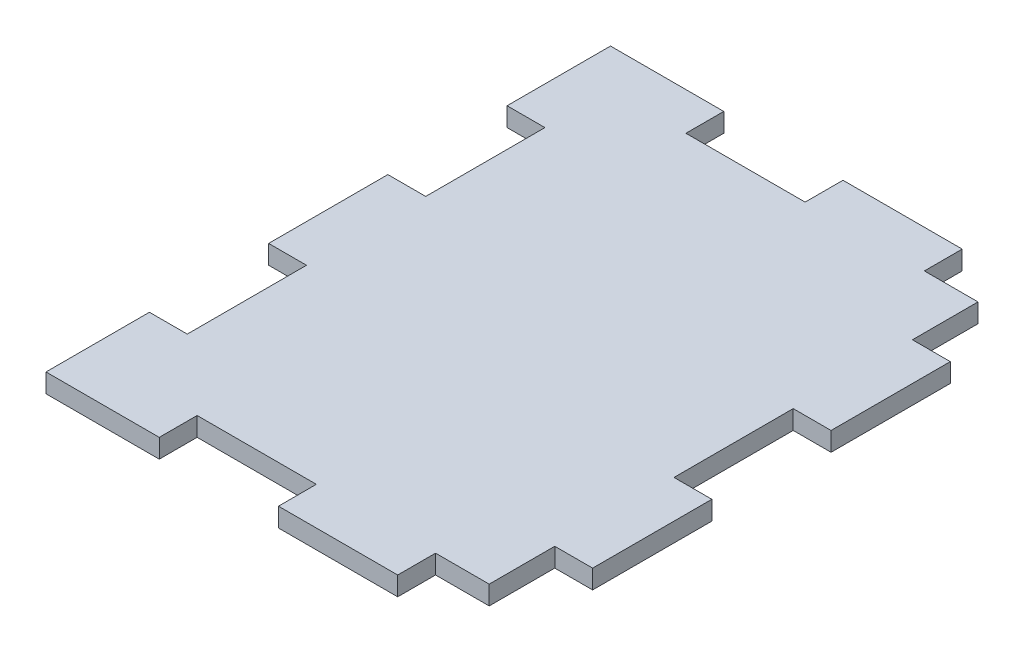
ISO-10303-21;
HEADER;
FILE_DESCRIPTION(('STEP AP214'),'2;1');
FILE_NAME('part.step','',(''),(''),'','','');
FILE_SCHEMA(('AUTOMOTIVE_DESIGN { 1 0 10303 214 1 1 1 1 }'));
ENDSEC;
DATA;
#1=APPLICATION_CONTEXT('core data for automotive mechanical design processes');
#2=APPLICATION_PROTOCOL_DEFINITION('international standard','automotive_design',2000,#1);
#3=PRODUCT_CONTEXT('',#1,'mechanical');
#4=PRODUCT('Part','Part','',(#3));
#5=PRODUCT_RELATED_PRODUCT_CATEGORY('part','',(#4));
#6=PRODUCT_DEFINITION_FORMATION('','',#4);
#7=PRODUCT_DEFINITION_CONTEXT('part definition',#1,'design');
#8=PRODUCT_DEFINITION('design','',#6,#7);
#9=PRODUCT_DEFINITION_SHAPE('','',#8);
#10=(LENGTH_UNIT() NAMED_UNIT(*) SI_UNIT(.MILLI.,.METRE.));
#11=(NAMED_UNIT(*) PLANE_ANGLE_UNIT() SI_UNIT($,.RADIAN.));
#12=(NAMED_UNIT(*) SI_UNIT($,.STERADIAN.) SOLID_ANGLE_UNIT());
#13=UNCERTAINTY_MEASURE_WITH_UNIT(LENGTH_MEASURE(1.E-05),#10,'distance_accuracy_value','');
#14=(GEOMETRIC_REPRESENTATION_CONTEXT(3) GLOBAL_UNCERTAINTY_ASSIGNED_CONTEXT((#13)) GLOBAL_UNIT_ASSIGNED_CONTEXT((#10,
#11,#12)) REPRESENTATION_CONTEXT('',''));
#15=CARTESIAN_POINT('',(0.,0.,0.));
#16=DIRECTION('',(0.,0.,1.));
#17=DIRECTION('',(1.,0.,0.));
#18=AXIS2_PLACEMENT_3D('',#15,#16,#17);
#19=CARTESIAN_POINT('',(0.,1.5875,-47.35));
#20=DIRECTION('',(0.,0.,1.));
#21=DIRECTION('',(1.,0.,0.));
#22=AXIS2_PLACEMENT_3D('',#19,#20,#21);
#23=PLANE('',#22);
#24=DIRECTION('',(0.,1.,0.));
#25=VECTOR('',#24,1.);
#26=CARTESIAN_POINT('',(9.49999999999975,0.,-47.35));
#27=LINE('',#26,#25);
#28=CARTESIAN_POINT('',(9.49999999999975,0.,-47.35));
#29=VERTEX_POINT('',#28);
#30=CARTESIAN_POINT('',(9.49999999999975,1.58750000000001,-47.35));
#31=VERTEX_POINT('',#30);
#32=EDGE_CURVE('E293',#29,#31,#27,.T.);
#33=ORIENTED_EDGE('',*,*,#32,.F.);
#34=DIRECTION('',(-1.,0.,0.));
#35=VECTOR('',#34,1.);
#36=CARTESIAN_POINT('',(0.,0.,-47.35));
#37=LINE('',#36,#35);
#38=CARTESIAN_POINT('',(0.,0.,-47.35));
#39=VERTEX_POINT('',#38);
#40=EDGE_CURVE('E469',#29,#39,#37,.T.);
#41=ORIENTED_EDGE('',*,*,#40,.T.);
#42=DIRECTION('',(0.,-1.,0.));
#43=VECTOR('',#42,1.);
#44=CARTESIAN_POINT('',(0.,1.5875,-47.35));
#45=LINE('',#44,#43);
#46=CARTESIAN_POINT('',(0.,1.5875,-47.35));
#47=VERTEX_POINT('',#46);
#48=EDGE_CURVE('E40',#47,#39,#45,.T.);
#49=ORIENTED_EDGE('',*,*,#48,.F.);
#50=DIRECTION('',(-1.,0.,0.));
#51=VECTOR('',#50,1.);
#52=CARTESIAN_POINT('',(0.,1.5875,-47.35));
#53=LINE('',#52,#51);
#54=EDGE_CURVE('E455',#31,#47,#53,.T.);
#55=ORIENTED_EDGE('',*,*,#54,.F.);
#56=EDGE_LOOP('',(#33,#41,#49,#55));
#57=FACE_BOUND('',#56,.T.);
#58=ADVANCED_FACE('F32',(#57),#23,.F.);
#59=CARTESIAN_POINT('',(0.,1.5875,0.));
#60=DIRECTION('',(0.,-1.,0.));
#61=DIRECTION('',(0.,0.,-1.));
#62=AXIS2_PLACEMENT_3D('',#59,#60,#61);
#63=PLANE('',#62);
#64=DIRECTION('',(0.,0.,-1.));
#65=VECTOR('',#64,1.);
#66=CARTESIAN_POINT('',(9.49999999999975,1.58750000000001,0.));
#67=LINE('',#66,#65);
#68=CARTESIAN_POINT('',(9.49999999999975,1.58750000000001,-44.175));
#69=VERTEX_POINT('',#68);
#70=EDGE_CURVE('E311',#69,#31,#67,.T.);
#71=ORIENTED_EDGE('',*,*,#70,.T.);
#72=ORIENTED_EDGE('',*,*,#54,.T.);
#73=DIRECTION('',(0.,0.,1.));
#74=VECTOR('',#73,1.);
#75=CARTESIAN_POINT('',(0.,1.5875,0.));
#76=LINE('',#75,#74);
#77=CARTESIAN_POINT('',(0.,1.5875,-38.675));
#78=VERTEX_POINT('',#77);
#79=EDGE_CURVE('E440',#47,#78,#76,.T.);
#80=ORIENTED_EDGE('',*,*,#79,.T.);
#81=DIRECTION('',(-1.,0.,0.));
#82=VECTOR('',#81,1.);
#83=CARTESIAN_POINT('',(0.,1.58750000000001,-38.675));
#84=LINE('',#83,#82);
#85=CARTESIAN_POINT('',(3.175,1.58750000000001,-38.675));
#86=VERTEX_POINT('',#85);
#87=EDGE_CURVE('E283',#86,#78,#84,.T.);
#88=ORIENTED_EDGE('',*,*,#87,.F.);
#89=DIRECTION('',(0.,0.,1.));
#90=VECTOR('',#89,1.);
#91=CARTESIAN_POINT('',(3.175,1.58750000000001,0.));
#92=LINE('',#91,#90);
#93=CARTESIAN_POINT('',(3.175,1.58750000000001,-28.675));
#94=VERTEX_POINT('',#93);
#95=EDGE_CURVE('E292',#86,#94,#92,.T.);
#96=ORIENTED_EDGE('',*,*,#95,.T.);
#97=DIRECTION('',(-1.,0.,0.));
#98=VECTOR('',#97,1.);
#99=CARTESIAN_POINT('',(0.,1.58750000000001,-28.675));
#100=LINE('',#99,#98);
#101=CARTESIAN_POINT('',(0.,1.58750000000001,-28.675));
#102=VERTEX_POINT('',#101);
#103=EDGE_CURVE('E289',#94,#102,#100,.T.);
#104=ORIENTED_EDGE('',*,*,#103,.T.);
#105=CARTESIAN_POINT('',(0.,1.5875,-18.675));
#106=VERTEX_POINT('',#105);
#107=EDGE_CURVE('E444',#102,#106,#76,.T.);
#108=ORIENTED_EDGE('',*,*,#107,.T.);
#109=DIRECTION('',(-1.,0.,0.));
#110=VECTOR('',#109,1.);
#111=CARTESIAN_POINT('',(0.,1.58750000000001,-18.675));
#112=LINE('',#111,#110);
#113=CARTESIAN_POINT('',(3.175,1.58750000000001,-18.675));
#114=VERTEX_POINT('',#113);
#115=EDGE_CURVE('E55',#114,#106,#112,.T.);
#116=ORIENTED_EDGE('',*,*,#115,.F.);
#117=DIRECTION('',(0.,0.,1.));
#118=VECTOR('',#117,1.);
#119=CARTESIAN_POINT('',(3.175,1.58750000000001,0.));
#120=LINE('',#119,#118);
#121=CARTESIAN_POINT('',(3.175,1.58750000000001,-8.67499999999887));
#122=VERTEX_POINT('',#121);
#123=EDGE_CURVE('E267',#114,#122,#120,.T.);
#124=ORIENTED_EDGE('',*,*,#123,.T.);
#125=DIRECTION('',(-1.,0.,0.));
#126=VECTOR('',#125,1.);
#127=CARTESIAN_POINT('',(0.,1.58750000000001,-8.67499999999887));
#128=LINE('',#127,#126);
#129=CARTESIAN_POINT('',(0.,1.58750000000001,-8.67499999999887));
#130=VERTEX_POINT('',#129);
#131=EDGE_CURVE('E258',#122,#130,#128,.T.);
#132=ORIENTED_EDGE('',*,*,#131,.T.);
#133=CARTESIAN_POINT('',(0.,1.5875,0.));
#134=VERTEX_POINT('',#133);
#135=EDGE_CURVE('E445',#130,#134,#76,.T.);
#136=ORIENTED_EDGE('',*,*,#135,.T.);
#137=DIRECTION('',(1.,0.,0.));
#138=VECTOR('',#137,1.);
#139=CARTESIAN_POINT('',(0.,1.5875,0.));
#140=LINE('',#139,#138);
#141=CARTESIAN_POINT('',(9.49999999999975,1.5875,0.));
#142=VERTEX_POINT('',#141);
#143=EDGE_CURVE('E446',#134,#142,#140,.T.);
#144=ORIENTED_EDGE('',*,*,#143,.T.);
#145=DIRECTION('',(0.,0.,1.));
#146=VECTOR('',#145,1.);
#147=CARTESIAN_POINT('',(9.49999999999975,1.58750000000001,0.));
#148=LINE('',#147,#146);
#149=CARTESIAN_POINT('',(9.49999999999975,1.58750000000001,-3.1749999999989));
#150=VERTEX_POINT('',#149);
#151=EDGE_CURVE('E396',#150,#142,#148,.T.);
#152=ORIENTED_EDGE('',*,*,#151,.F.);
#153=DIRECTION('',(-1.,0.,0.));
#154=VECTOR('',#153,1.);
#155=CARTESIAN_POINT('',(0.,1.58750000000001,-3.1749999999989));
#156=LINE('',#155,#154);
#157=CARTESIAN_POINT('',(19.4999999999998,1.58750000000001,-3.1749999999989));
#158=VERTEX_POINT('',#157);
#159=EDGE_CURVE('E276',#158,#150,#156,.T.);
#160=ORIENTED_EDGE('',*,*,#159,.F.);
#161=DIRECTION('',(0.,0.,1.));
#162=VECTOR('',#161,1.);
#163=CARTESIAN_POINT('',(19.4999999999998,1.58750000000001,0.));
#164=LINE('',#163,#162);
#165=CARTESIAN_POINT('',(19.4999999999998,1.58750000000001,0.));
#166=VERTEX_POINT('',#165);
#167=EDGE_CURVE('E388',#158,#166,#164,.T.);
#168=ORIENTED_EDGE('',*,*,#167,.T.);
#169=CARTESIAN_POINT('',(29.4999999999998,1.58750000000001,0.));
#170=VERTEX_POINT('',#169);
#171=EDGE_CURVE('E443',#166,#170,#140,.T.);
#172=ORIENTED_EDGE('',*,*,#171,.T.);
#173=DIRECTION('',(0.,0.,1.));
#174=VECTOR('',#173,1.);
#175=CARTESIAN_POINT('',(29.4999999999998,1.58750000000001,0.));
#176=LINE('',#175,#174);
#177=CARTESIAN_POINT('',(29.4999999999998,1.58750000000001,-3.1749999999989));
#178=VERTEX_POINT('',#177);
#179=EDGE_CURVE('E367',#178,#170,#176,.T.);
#180=ORIENTED_EDGE('',*,*,#179,.F.);
#181=DIRECTION('',(1.,0.,0.));
#182=VECTOR('',#181,1.);
#183=CARTESIAN_POINT('',(0.,1.58750000000001,-3.1749999999989));
#184=LINE('',#183,#182);
#185=CARTESIAN_POINT('',(34.,1.58750000000001,-3.1749999999989));
#186=VERTEX_POINT('',#185);
#187=EDGE_CURVE('E364',#178,#186,#184,.T.);
#188=ORIENTED_EDGE('',*,*,#187,.T.);
#189=DIRECTION('',(0.,0.,1.));
#190=VECTOR('',#189,1.);
#191=CARTESIAN_POINT('',(34.,1.58750000000001,0.));
#192=LINE('',#191,#190);
#193=CARTESIAN_POINT('',(34.,1.58750000000001,-8.67499999999887));
#194=VERTEX_POINT('',#193);
#195=EDGE_CURVE('E355',#194,#186,#192,.T.);
#196=ORIENTED_EDGE('',*,*,#195,.F.);
#197=DIRECTION('',(1.,0.,0.));
#198=VECTOR('',#197,1.);
#199=CARTESIAN_POINT('',(0.,1.58750000000001,-8.67499999999887));
#200=LINE('',#199,#198);
#201=CARTESIAN_POINT('',(37.175,1.58750000000001,-8.67499999999887));
#202=VERTEX_POINT('',#201);
#203=EDGE_CURVE('E370',#194,#202,#200,.T.);
#204=ORIENTED_EDGE('',*,*,#203,.T.);
#205=DIRECTION('',(0.,0.,-1.));
#206=VECTOR('',#205,1.);
#207=CARTESIAN_POINT('',(37.175,1.5875,0.));
#208=LINE('',#207,#206);
#209=CARTESIAN_POINT('',(37.175,1.5875,-18.675));
#210=VERTEX_POINT('',#209);
#211=EDGE_CURVE('E451',#202,#210,#208,.T.);
#212=ORIENTED_EDGE('',*,*,#211,.T.);
#213=DIRECTION('',(1.,0.,0.));
#214=VECTOR('',#213,1.);
#215=CARTESIAN_POINT('',(0.,1.58750000000001,-18.675));
#216=LINE('',#215,#214);
#217=CARTESIAN_POINT('',(34.,1.58750000000001,-18.675));
#218=VERTEX_POINT('',#217);
#219=EDGE_CURVE('E328',#218,#210,#216,.T.);
#220=ORIENTED_EDGE('',*,*,#219,.F.);
#221=DIRECTION('',(0.,0.,1.));
#222=VECTOR('',#221,1.);
#223=CARTESIAN_POINT('',(34.,1.58750000000001,0.));
#224=LINE('',#223,#222);
#225=CARTESIAN_POINT('',(34.,1.58750000000001,-28.675));
#226=VERTEX_POINT('',#225);
#227=EDGE_CURVE('E338',#226,#218,#224,.T.);
#228=ORIENTED_EDGE('',*,*,#227,.F.);
#229=DIRECTION('',(1.,0.,0.));
#230=VECTOR('',#229,1.);
#231=CARTESIAN_POINT('',(0.,1.58750000000001,-28.675));
#232=LINE('',#231,#230);
#233=CARTESIAN_POINT('',(37.175,1.58750000000001,-28.675));
#234=VERTEX_POINT('',#233);
#235=EDGE_CURVE('E335',#226,#234,#232,.T.);
#236=ORIENTED_EDGE('',*,*,#235,.T.);
#237=CARTESIAN_POINT('',(37.175,1.58750000000001,-38.675));
#238=VERTEX_POINT('',#237);
#239=EDGE_CURVE('E449',#234,#238,#208,.T.);
#240=ORIENTED_EDGE('',*,*,#239,.T.);
#241=DIRECTION('',(1.,0.,0.));
#242=VECTOR('',#241,1.);
#243=CARTESIAN_POINT('',(5.93275428784068E-13,1.58750000000001,-38.6750000000006));
#244=LINE('',#243,#242);
#245=CARTESIAN_POINT('',(34.,1.58750000000001,-38.675));
#246=VERTEX_POINT('',#245);
#247=EDGE_CURVE('E410',#246,#238,#244,.T.);
#248=ORIENTED_EDGE('',*,*,#247,.F.);
#249=DIRECTION('',(0.,0.,-1.));
#250=VECTOR('',#249,1.);
#251=CARTESIAN_POINT('',(34.,1.58750000000001,0.));
#252=LINE('',#251,#250);
#253=CARTESIAN_POINT('',(34.,1.58750000000001,-44.175));
#254=VERTEX_POINT('',#253);
#255=EDGE_CURVE('E425',#246,#254,#252,.T.);
#256=ORIENTED_EDGE('',*,*,#255,.T.);
#257=DIRECTION('',(1.,0.,0.));
#258=VECTOR('',#257,1.);
#259=CARTESIAN_POINT('',(0.,1.58750000000001,-44.175));
#260=LINE('',#259,#258);
#261=CARTESIAN_POINT('',(29.4999999999998,1.58750000000001,-44.175));
#262=VERTEX_POINT('',#261);
#263=EDGE_CURVE('E422',#262,#254,#260,.T.);
#264=ORIENTED_EDGE('',*,*,#263,.F.);
#265=DIRECTION('',(0.,0.,-1.));
#266=VECTOR('',#265,1.);
#267=CARTESIAN_POINT('',(29.4999999999998,1.58750000000001,0.));
#268=LINE('',#267,#266);
#269=CARTESIAN_POINT('',(29.4999999999998,1.58750000000001,-47.35));
#270=VERTEX_POINT('',#269);
#271=EDGE_CURVE('E345',#262,#270,#268,.T.);
#272=ORIENTED_EDGE('',*,*,#271,.T.);
#273=CARTESIAN_POINT('',(19.4999999999998,1.58750000000001,-47.35));
#274=VERTEX_POINT('',#273);
#275=EDGE_CURVE('E452',#270,#274,#53,.T.);
#276=ORIENTED_EDGE('',*,*,#275,.T.);
#277=DIRECTION('',(0.,0.,-1.));
#278=VECTOR('',#277,1.);
#279=CARTESIAN_POINT('',(19.4999999999998,1.58750000000001,0.));
#280=LINE('',#279,#278);
#281=CARTESIAN_POINT('',(19.4999999999998,1.58750000000001,-44.175));
#282=VERTEX_POINT('',#281);
#283=EDGE_CURVE('E307',#282,#274,#280,.T.);
#284=ORIENTED_EDGE('',*,*,#283,.F.);
#285=DIRECTION('',(-1.,0.,0.));
#286=VECTOR('',#285,1.);
#287=CARTESIAN_POINT('',(0.,1.58750000000001,-44.175));
#288=LINE('',#287,#286);
#289=EDGE_CURVE('E314',#282,#69,#288,.T.);
#290=ORIENTED_EDGE('',*,*,#289,.T.);
#291=EDGE_LOOP('',(#71,#72,#80,#88,#96,#104,#108,#116,#124,#132,#136,#144,#152,#160,#168,#172,
#180,#188,#196,#204,#212,#220,#228,#236,#240,#248,#256,#264,#272,#276,#284,#290));
#292=FACE_BOUND('',#291,.T.);
#293=ADVANCED_FACE('F486',(#292),#63,.F.);
#294=CARTESIAN_POINT('',(0.,0.,0.));
#295=DIRECTION('',(0.,-1.,0.));
#296=DIRECTION('',(0.,0.,-1.));
#297=AXIS2_PLACEMENT_3D('',#294,#295,#296);
#298=PLANE('',#297);
#299=ORIENTED_EDGE('',*,*,#40,.F.);
#300=DIRECTION('',(0.,0.,-1.));
#301=VECTOR('',#300,1.);
#302=CARTESIAN_POINT('',(9.49999999999975,0.,0.));
#303=LINE('',#302,#301);
#304=CARTESIAN_POINT('',(9.49999999999975,0.,-44.175));
#305=VERTEX_POINT('',#304);
#306=EDGE_CURVE('E304',#305,#29,#303,.T.);
#307=ORIENTED_EDGE('',*,*,#306,.F.);
#308=DIRECTION('',(-1.,0.,0.));
#309=VECTOR('',#308,1.);
#310=CARTESIAN_POINT('',(0.,0.,-44.175));
#311=LINE('',#310,#309);
#312=CARTESIAN_POINT('',(19.4999999999998,0.,-44.175));
#313=VERTEX_POINT('',#312);
#314=EDGE_CURVE('E306',#313,#305,#311,.T.);
#315=ORIENTED_EDGE('',*,*,#314,.F.);
#316=DIRECTION('',(0.,0.,-1.));
#317=VECTOR('',#316,1.);
#318=CARTESIAN_POINT('',(19.4999999999998,0.,0.));
#319=LINE('',#318,#317);
#320=CARTESIAN_POINT('',(19.4999999999998,0.,-47.35));
#321=VERTEX_POINT('',#320);
#322=EDGE_CURVE('E47',#313,#321,#319,.T.);
#323=ORIENTED_EDGE('',*,*,#322,.T.);
#324=CARTESIAN_POINT('',(29.4999999999998,0.,-47.35));
#325=VERTEX_POINT('',#324);
#326=EDGE_CURVE('E467',#325,#321,#37,.T.);
#327=ORIENTED_EDGE('',*,*,#326,.F.);
#328=DIRECTION('',(0.,0.,-1.));
#329=VECTOR('',#328,1.);
#330=CARTESIAN_POINT('',(29.4999999999998,0.,0.));
#331=LINE('',#330,#329);
#332=CARTESIAN_POINT('',(29.4999999999998,0.,-44.175));
#333=VERTEX_POINT('',#332);
#334=EDGE_CURVE('E407',#333,#325,#331,.T.);
#335=ORIENTED_EDGE('',*,*,#334,.F.);
#336=DIRECTION('',(1.,0.,0.));
#337=VECTOR('',#336,1.);
#338=CARTESIAN_POINT('',(0.,0.,-44.175));
#339=LINE('',#338,#337);
#340=CARTESIAN_POINT('',(34.,0.,-44.175));
#341=VERTEX_POINT('',#340);
#342=EDGE_CURVE('E409',#333,#341,#339,.T.);
#343=ORIENTED_EDGE('',*,*,#342,.T.);
#344=DIRECTION('',(0.,0.,-1.));
#345=VECTOR('',#344,1.);
#346=CARTESIAN_POINT('',(34.,0.,0.));
#347=LINE('',#346,#345);
#348=CARTESIAN_POINT('',(34.,0.,-38.675));
#349=VERTEX_POINT('',#348);
#350=EDGE_CURVE('E413',#349,#341,#347,.T.);
#351=ORIENTED_EDGE('',*,*,#350,.F.);
#352=DIRECTION('',(1.,0.,0.));
#353=VECTOR('',#352,1.);
#354=CARTESIAN_POINT('',(5.93275428784068E-13,0.,-38.6750000000006));
#355=LINE('',#354,#353);
#356=CARTESIAN_POINT('',(37.175,0.,-38.675));
#357=VERTEX_POINT('',#356);
#358=EDGE_CURVE('E416',#349,#357,#355,.T.);
#359=ORIENTED_EDGE('',*,*,#358,.T.);
#360=DIRECTION('',(0.,0.,-1.));
#361=VECTOR('',#360,1.);
#362=CARTESIAN_POINT('',(37.175,0.,0.));
#363=LINE('',#362,#361);
#364=CARTESIAN_POINT('',(37.175,0.,-28.675));
#365=VERTEX_POINT('',#364);
#366=EDGE_CURVE('E464',#365,#357,#363,.T.);
#367=ORIENTED_EDGE('',*,*,#366,.F.);
#368=DIRECTION('',(1.,0.,0.));
#369=VECTOR('',#368,1.);
#370=CARTESIAN_POINT('',(0.,0.,-28.675));
#371=LINE('',#370,#369);
#372=CARTESIAN_POINT('',(34.,0.,-28.675));
#373=VERTEX_POINT('',#372);
#374=EDGE_CURVE('E325',#373,#365,#371,.T.);
#375=ORIENTED_EDGE('',*,*,#374,.F.);
#376=DIRECTION('',(0.,0.,1.));
#377=VECTOR('',#376,1.);
#378=CARTESIAN_POINT('',(34.,0.,0.));
#379=LINE('',#378,#377);
#380=CARTESIAN_POINT('',(34.,0.,-18.675));
#381=VERTEX_POINT('',#380);
#382=EDGE_CURVE('E327',#373,#381,#379,.T.);
#383=ORIENTED_EDGE('',*,*,#382,.T.);
#384=DIRECTION('',(1.,0.,0.));
#385=VECTOR('',#384,1.);
#386=CARTESIAN_POINT('',(0.,0.,-18.675));
#387=LINE('',#386,#385);
#388=CARTESIAN_POINT('',(37.175,0.,-18.675));
#389=VERTEX_POINT('',#388);
#390=EDGE_CURVE('E331',#381,#389,#387,.T.);
#391=ORIENTED_EDGE('',*,*,#390,.T.);
#392=CARTESIAN_POINT('',(37.175,0.,-8.67499999999887));
#393=VERTEX_POINT('',#392);
#394=EDGE_CURVE('E466',#393,#389,#363,.T.);
#395=ORIENTED_EDGE('',*,*,#394,.F.);
#396=DIRECTION('',(1.,0.,0.));
#397=VECTOR('',#396,1.);
#398=CARTESIAN_POINT('',(0.,0.,-8.67499999999887));
#399=LINE('',#398,#397);
#400=CARTESIAN_POINT('',(34.,0.,-8.67499999999887));
#401=VERTEX_POINT('',#400);
#402=EDGE_CURVE('E358',#401,#393,#399,.T.);
#403=ORIENTED_EDGE('',*,*,#402,.F.);
#404=DIRECTION('',(0.,0.,1.));
#405=VECTOR('',#404,1.);
#406=CARTESIAN_POINT('',(34.,0.,0.));
#407=LINE('',#406,#405);
#408=CARTESIAN_POINT('',(34.,0.,-3.1749999999989));
#409=VERTEX_POINT('',#408);
#410=EDGE_CURVE('E360',#401,#409,#407,.T.);
#411=ORIENTED_EDGE('',*,*,#410,.T.);
#412=DIRECTION('',(1.,0.,0.));
#413=VECTOR('',#412,1.);
#414=CARTESIAN_POINT('',(0.,0.,-3.1749999999989));
#415=LINE('',#414,#413);
#416=CARTESIAN_POINT('',(29.4999999999998,0.,-3.1749999999989));
#417=VERTEX_POINT('',#416);
#418=EDGE_CURVE('E352',#417,#409,#415,.T.);
#419=ORIENTED_EDGE('',*,*,#418,.F.);
#420=DIRECTION('',(0.,0.,1.));
#421=VECTOR('',#420,1.);
#422=CARTESIAN_POINT('',(29.4999999999998,0.,0.));
#423=LINE('',#422,#421);
#424=CARTESIAN_POINT('',(29.4999999999998,0.,0.));
#425=VERTEX_POINT('',#424);
#426=EDGE_CURVE('E354',#417,#425,#423,.T.);
#427=ORIENTED_EDGE('',*,*,#426,.T.);
#428=DIRECTION('',(1.,0.,0.));
#429=VECTOR('',#428,1.);
#430=CARTESIAN_POINT('',(0.,0.,0.));
#431=LINE('',#430,#429);
#432=CARTESIAN_POINT('',(19.4999999999998,0.,0.));
#433=VERTEX_POINT('',#432);
#434=EDGE_CURVE('E459',#433,#425,#431,.T.);
#435=ORIENTED_EDGE('',*,*,#434,.F.);
#436=DIRECTION('',(0.,0.,1.));
#437=VECTOR('',#436,1.);
#438=CARTESIAN_POINT('',(19.4999999999998,0.,0.));
#439=LINE('',#438,#437);
#440=CARTESIAN_POINT('',(19.4999999999998,0.,-3.1749999999989));
#441=VERTEX_POINT('',#440);
#442=EDGE_CURVE('E391',#441,#433,#439,.T.);
#443=ORIENTED_EDGE('',*,*,#442,.F.);
#444=DIRECTION('',(-1.,0.,0.));
#445=VECTOR('',#444,1.);
#446=CARTESIAN_POINT('',(0.,0.,-3.1749999999989));
#447=LINE('',#446,#445);
#448=CARTESIAN_POINT('',(9.49999999999975,0.,-3.1749999999989));
#449=VERTEX_POINT('',#448);
#450=EDGE_CURVE('E384',#441,#449,#447,.T.);
#451=ORIENTED_EDGE('',*,*,#450,.T.);
#452=DIRECTION('',(0.,0.,1.));
#453=VECTOR('',#452,1.);
#454=CARTESIAN_POINT('',(9.49999999999975,0.,0.));
#455=LINE('',#454,#453);
#456=CARTESIAN_POINT('',(9.49999999999975,0.,0.));
#457=VERTEX_POINT('',#456);
#458=EDGE_CURVE('E387',#449,#457,#455,.T.);
#459=ORIENTED_EDGE('',*,*,#458,.T.);
#460=CARTESIAN_POINT('',(0.,0.,0.));
#461=VERTEX_POINT('',#460);
#462=EDGE_CURVE('E461',#461,#457,#431,.T.);
#463=ORIENTED_EDGE('',*,*,#462,.F.);
#464=DIRECTION('',(0.,0.,1.));
#465=VECTOR('',#464,1.);
#466=CARTESIAN_POINT('',(0.,0.,0.));
#467=LINE('',#466,#465);
#468=CARTESIAN_POINT('',(0.,0.,-8.67499999999887));
#469=VERTEX_POINT('',#468);
#470=EDGE_CURVE('E265',#469,#461,#467,.T.);
#471=ORIENTED_EDGE('',*,*,#470,.F.);
#472=DIRECTION('',(-1.,0.,0.));
#473=VECTOR('',#472,1.);
#474=CARTESIAN_POINT('',(0.,0.,-8.67499999999887));
#475=LINE('',#474,#473);
#476=CARTESIAN_POINT('',(3.175,0.,-8.67499999999887));
#477=VERTEX_POINT('',#476);
#478=EDGE_CURVE('E252',#477,#469,#475,.T.);
#479=ORIENTED_EDGE('',*,*,#478,.F.);
#480=DIRECTION('',(0.,0.,1.));
#481=VECTOR('',#480,1.);
#482=CARTESIAN_POINT('',(3.175,0.,0.));
#483=LINE('',#482,#481);
#484=CARTESIAN_POINT('',(3.175,0.,-18.675));
#485=VERTEX_POINT('',#484);
#486=EDGE_CURVE('E240',#485,#477,#483,.T.);
#487=ORIENTED_EDGE('',*,*,#486,.F.);
#488=DIRECTION('',(-1.,0.,0.));
#489=VECTOR('',#488,1.);
#490=CARTESIAN_POINT('',(0.,0.,-18.675));
#491=LINE('',#490,#489);
#492=CARTESIAN_POINT('',(0.,0.,-18.675));
#493=VERTEX_POINT('',#492);
#494=EDGE_CURVE('E251',#485,#493,#491,.T.);
#495=ORIENTED_EDGE('',*,*,#494,.T.);
#496=CARTESIAN_POINT('',(0.,0.,-28.675));
#497=VERTEX_POINT('',#496);
#498=EDGE_CURVE('E460',#497,#493,#467,.T.);
#499=ORIENTED_EDGE('',*,*,#498,.F.);
#500=DIRECTION('',(-1.,0.,0.));
#501=VECTOR('',#500,1.);
#502=CARTESIAN_POINT('',(0.,0.,-28.675));
#503=LINE('',#502,#501);
#504=CARTESIAN_POINT('',(3.175,0.,-28.675));
#505=VERTEX_POINT('',#504);
#506=EDGE_CURVE('E280',#505,#497,#503,.T.);
#507=ORIENTED_EDGE('',*,*,#506,.F.);
#508=DIRECTION('',(0.,0.,1.));
#509=VECTOR('',#508,1.);
#510=CARTESIAN_POINT('',(3.175,0.,0.));
#511=LINE('',#510,#509);
#512=CARTESIAN_POINT('',(3.175,0.,-38.675));
#513=VERTEX_POINT('',#512);
#514=EDGE_CURVE('E282',#513,#505,#511,.T.);
#515=ORIENTED_EDGE('',*,*,#514,.F.);
#516=DIRECTION('',(-1.,0.,0.));
#517=VECTOR('',#516,1.);
#518=CARTESIAN_POINT('',(0.,0.,-38.675));
#519=LINE('',#518,#517);
#520=CARTESIAN_POINT('',(0.,0.,-38.675));
#521=VERTEX_POINT('',#520);
#522=EDGE_CURVE('E285',#513,#521,#519,.T.);
#523=ORIENTED_EDGE('',*,*,#522,.T.);
#524=EDGE_CURVE('E456',#39,#521,#467,.T.);
#525=ORIENTED_EDGE('',*,*,#524,.F.);
#526=EDGE_LOOP('',(#299,#307,#315,#323,#327,#335,#343,#351,#359,#367,#375,#383,#391,#395,#403,
#411,#419,#427,#435,#443,#451,#459,#463,#471,#479,#487,#495,#499,#507,#515,#523,#525));
#527=FACE_BOUND('',#526,.T.);
#528=ADVANCED_FACE('F263',(#527),#298,.T.);
#529=CARTESIAN_POINT('',(0.,1.5875,0.));
#530=DIRECTION('',(1.,0.,0.));
#531=DIRECTION('',(0.,0.,-1.));
#532=AXIS2_PLACEMENT_3D('',#529,#530,#531);
#533=PLANE('',#532);
#534=DIRECTION('',(0.,1.,0.));
#535=VECTOR('',#534,1.);
#536=CARTESIAN_POINT('',(0.,0.,-28.675));
#537=LINE('',#536,#535);
#538=EDGE_CURVE('E272',#497,#102,#537,.T.);
#539=ORIENTED_EDGE('',*,*,#538,.F.);
#540=ORIENTED_EDGE('',*,*,#498,.T.);
#541=DIRECTION('',(0.,1.,0.));
#542=VECTOR('',#541,1.);
#543=CARTESIAN_POINT('',(0.,0.,-18.675));
#544=LINE('',#543,#542);
#545=EDGE_CURVE('E277',#493,#106,#544,.T.);
#546=ORIENTED_EDGE('',*,*,#545,.T.);
#547=ORIENTED_EDGE('',*,*,#107,.F.);
#548=EDGE_LOOP('',(#539,#540,#546,#547));
#549=FACE_BOUND('',#548,.T.);
#550=ADVANCED_FACE('F570',(#549),#533,.F.);
#551=DIRECTION('',(0.,1.,0.));
#552=VECTOR('',#551,1.);
#553=CARTESIAN_POINT('',(0.,0.,-8.67499999999887));
#554=LINE('',#553,#552);
#555=EDGE_CURVE('E274',#469,#130,#554,.T.);
#556=ORIENTED_EDGE('',*,*,#555,.F.);
#557=ORIENTED_EDGE('',*,*,#470,.T.);
#558=DIRECTION('',(0.,-1.,0.));
#559=VECTOR('',#558,1.);
#560=CARTESIAN_POINT('',(0.,1.5875,0.));
#561=LINE('',#560,#559);
#562=EDGE_CURVE('E11',#134,#461,#561,.T.);
#563=ORIENTED_EDGE('',*,*,#562,.F.);
#564=ORIENTED_EDGE('',*,*,#135,.F.);
#565=EDGE_LOOP('',(#556,#557,#563,#564));
#566=FACE_BOUND('',#565,.T.);
#567=ADVANCED_FACE('F571',(#566),#533,.F.);
#568=CARTESIAN_POINT('',(0.,1.5875,0.));
#569=DIRECTION('',(0.,0.,-1.));
#570=DIRECTION('',(-1.,0.,0.));
#571=AXIS2_PLACEMENT_3D('',#568,#569,#570);
#572=PLANE('',#571);
#573=DIRECTION('',(0.,1.,0.));
#574=VECTOR('',#573,1.);
#575=CARTESIAN_POINT('',(19.4999999999998,0.,0.));
#576=LINE('',#575,#574);
#577=EDGE_CURVE('E401',#433,#166,#576,.T.);
#578=ORIENTED_EDGE('',*,*,#577,.F.);
#579=ORIENTED_EDGE('',*,*,#434,.T.);
#580=DIRECTION('',(0.,1.,0.));
#581=VECTOR('',#580,1.);
#582=CARTESIAN_POINT('',(29.4999999999998,0.,0.));
#583=LINE('',#582,#581);
#584=EDGE_CURVE('E380',#425,#170,#583,.T.);
#585=ORIENTED_EDGE('',*,*,#584,.T.);
#586=ORIENTED_EDGE('',*,*,#171,.F.);
#587=EDGE_LOOP('',(#578,#579,#585,#586));
#588=FACE_BOUND('',#587,.T.);
#589=ADVANCED_FACE('F575',(#588),#572,.F.);
#590=CARTESIAN_POINT('',(37.175,1.5875,0.));
#591=DIRECTION('',(-1.,0.,0.));
#592=DIRECTION('',(0.,0.,1.));
#593=AXIS2_PLACEMENT_3D('',#590,#591,#592);
#594=PLANE('',#593);
#595=DIRECTION('',(0.,1.,0.));
#596=VECTOR('',#595,1.);
#597=CARTESIAN_POINT('',(37.175,0.,-8.67499999999887));
#598=LINE('',#597,#596);
#599=EDGE_CURVE('E378',#393,#202,#598,.T.);
#600=ORIENTED_EDGE('',*,*,#599,.F.);
#601=ORIENTED_EDGE('',*,*,#394,.T.);
#602=DIRECTION('',(0.,1.,0.));
#603=VECTOR('',#602,1.);
#604=CARTESIAN_POINT('',(37.175,0.,-18.675));
#605=LINE('',#604,#603);
#606=EDGE_CURVE('E346',#389,#210,#605,.T.);
#607=ORIENTED_EDGE('',*,*,#606,.T.);
#608=ORIENTED_EDGE('',*,*,#211,.F.);
#609=EDGE_LOOP('',(#600,#601,#607,#608));
#610=FACE_BOUND('',#609,.T.);
#611=ADVANCED_FACE('F497',(#610),#594,.F.);
#612=DIRECTION('',(0.,1.,0.));
#613=VECTOR('',#612,1.);
#614=CARTESIAN_POINT('',(37.175,0.,-28.675));
#615=LINE('',#614,#613);
#616=EDGE_CURVE('E343',#365,#234,#615,.T.);
#617=ORIENTED_EDGE('',*,*,#616,.F.);
#618=ORIENTED_EDGE('',*,*,#366,.T.);
#619=DIRECTION('',(0.,1.,0.));
#620=VECTOR('',#619,1.);
#621=CARTESIAN_POINT('',(37.175,0.,-38.675));
#622=LINE('',#621,#620);
#623=EDGE_CURVE('E432',#357,#238,#622,.T.);
#624=ORIENTED_EDGE('',*,*,#623,.T.);
#625=ORIENTED_EDGE('',*,*,#239,.F.);
#626=EDGE_LOOP('',(#617,#618,#624,#625));
#627=FACE_BOUND('',#626,.T.);
#628=ADVANCED_FACE('F515',(#627),#594,.F.);
#629=ORIENTED_EDGE('',*,*,#326,.T.);
#630=DIRECTION('',(0.,1.,0.));
#631=VECTOR('',#630,1.);
#632=CARTESIAN_POINT('',(19.4999999999998,0.,-47.35));
#633=LINE('',#632,#631);
#634=EDGE_CURVE('E319',#321,#274,#633,.T.);
#635=ORIENTED_EDGE('',*,*,#634,.T.);
#636=ORIENTED_EDGE('',*,*,#275,.F.);
#637=DIRECTION('',(0.,1.,0.));
#638=VECTOR('',#637,1.);
#639=CARTESIAN_POINT('',(29.4999999999998,0.,-47.35));
#640=LINE('',#639,#638);
#641=EDGE_CURVE('E430',#325,#270,#640,.T.);
#642=ORIENTED_EDGE('',*,*,#641,.F.);
#643=EDGE_LOOP('',(#629,#635,#636,#642));
#644=FACE_BOUND('',#643,.T.);
#645=ADVANCED_FACE('F536',(#644),#23,.F.);
#646=ORIENTED_EDGE('',*,*,#524,.T.);
#647=DIRECTION('',(0.,1.,0.));
#648=VECTOR('',#647,1.);
#649=CARTESIAN_POINT('',(0.,0.,-38.675));
#650=LINE('',#649,#648);
#651=EDGE_CURVE('E298',#521,#78,#650,.T.);
#652=ORIENTED_EDGE('',*,*,#651,.T.);
#653=ORIENTED_EDGE('',*,*,#79,.F.);
#654=ORIENTED_EDGE('',*,*,#48,.T.);
#655=EDGE_LOOP('',(#646,#652,#653,#654));
#656=FACE_BOUND('',#655,.T.);
#657=ADVANCED_FACE('F34',(#656),#533,.F.);
#658=ORIENTED_EDGE('',*,*,#462,.T.);
#659=DIRECTION('',(0.,1.,0.));
#660=VECTOR('',#659,1.);
#661=CARTESIAN_POINT('',(9.49999999999975,0.,0.));
#662=LINE('',#661,#660);
#663=EDGE_CURVE('E403',#457,#142,#662,.T.);
#664=ORIENTED_EDGE('',*,*,#663,.T.);
#665=ORIENTED_EDGE('',*,*,#143,.F.);
#666=ORIENTED_EDGE('',*,*,#562,.T.);
#667=EDGE_LOOP('',(#658,#664,#665,#666));
#668=FACE_BOUND('',#667,.T.);
#669=ADVANCED_FACE('F569',(#668),#572,.F.);
#670=CARTESIAN_POINT('',(29.4999999999998,0.,0.));
#671=DIRECTION('',(1.,0.,0.));
#672=DIRECTION('',(0.,0.,-1.));
#673=AXIS2_PLACEMENT_3D('',#670,#671,#672);
#674=PLANE('',#673);
#675=ORIENTED_EDGE('',*,*,#271,.F.);
#676=DIRECTION('',(0.,1.,0.));
#677=VECTOR('',#676,1.);
#678=CARTESIAN_POINT('',(29.4999999999998,0.,-44.175));
#679=LINE('',#678,#677);
#680=EDGE_CURVE('E419',#333,#262,#679,.T.);
#681=ORIENTED_EDGE('',*,*,#680,.F.);
#682=ORIENTED_EDGE('',*,*,#334,.T.);
#683=ORIENTED_EDGE('',*,*,#641,.T.);
#684=EDGE_LOOP('',(#675,#681,#682,#683));
#685=FACE_BOUND('',#684,.T.);
#686=ADVANCED_FACE('F532',(#685),#674,.T.);
#687=CARTESIAN_POINT('',(5.93275428784068E-13,0.,-38.6750000000006));
#688=DIRECTION('',(0.,0.,1.));
#689=DIRECTION('',(1.,0.,0.));
#690=AXIS2_PLACEMENT_3D('',#687,#688,#689);
#691=PLANE('',#690);
#692=ORIENTED_EDGE('',*,*,#247,.T.);
#693=ORIENTED_EDGE('',*,*,#623,.F.);
#694=ORIENTED_EDGE('',*,*,#358,.F.);
#695=DIRECTION('',(0.,1.,0.));
#696=VECTOR('',#695,1.);
#697=CARTESIAN_POINT('',(34.,0.,-38.675));
#698=LINE('',#697,#696);
#699=EDGE_CURVE('E435',#349,#246,#698,.T.);
#700=ORIENTED_EDGE('',*,*,#699,.T.);
#701=EDGE_LOOP('',(#692,#693,#694,#700));
#702=FACE_BOUND('',#701,.T.);
#703=ADVANCED_FACE('F519',(#702),#691,.F.);
#704=CARTESIAN_POINT('',(34.,0.,0.));
#705=DIRECTION('',(1.,0.,0.));
#706=DIRECTION('',(0.,0.,-1.));
#707=AXIS2_PLACEMENT_3D('',#704,#705,#706);
#708=PLANE('',#707);
#709=ORIENTED_EDGE('',*,*,#255,.F.);
#710=ORIENTED_EDGE('',*,*,#699,.F.);
#711=ORIENTED_EDGE('',*,*,#350,.T.);
#712=DIRECTION('',(0.,1.,0.));
#713=VECTOR('',#712,1.);
#714=CARTESIAN_POINT('',(34.,0.,-44.175));
#715=LINE('',#714,#713);
#716=EDGE_CURVE('E437',#341,#254,#715,.T.);
#717=ORIENTED_EDGE('',*,*,#716,.T.);
#718=EDGE_LOOP('',(#709,#710,#711,#717));
#719=FACE_BOUND('',#718,.T.);
#720=ADVANCED_FACE('F525',(#719),#708,.T.);
#721=CARTESIAN_POINT('',(0.,0.,-44.175));
#722=DIRECTION('',(0.,0.,1.));
#723=DIRECTION('',(1.,0.,0.));
#724=AXIS2_PLACEMENT_3D('',#721,#722,#723);
#725=PLANE('',#724);
#726=ORIENTED_EDGE('',*,*,#263,.T.);
#727=ORIENTED_EDGE('',*,*,#716,.F.);
#728=ORIENTED_EDGE('',*,*,#342,.F.);
#729=ORIENTED_EDGE('',*,*,#680,.T.);
#730=EDGE_LOOP('',(#726,#727,#728,#729));
#731=FACE_BOUND('',#730,.T.);
#732=ADVANCED_FACE('F530',(#731),#725,.F.);
#733=CARTESIAN_POINT('',(0.,0.,-28.675));
#734=DIRECTION('',(0.,0.,1.));
#735=DIRECTION('',(1.,0.,0.));
#736=AXIS2_PLACEMENT_3D('',#733,#734,#735);
#737=PLANE('',#736);
#738=ORIENTED_EDGE('',*,*,#235,.F.);
#739=DIRECTION('',(0.,1.,0.));
#740=VECTOR('',#739,1.);
#741=CARTESIAN_POINT('',(34.,0.,-28.675));
#742=LINE('',#741,#740);
#743=EDGE_CURVE('E334',#373,#226,#742,.T.);
#744=ORIENTED_EDGE('',*,*,#743,.F.);
#745=ORIENTED_EDGE('',*,*,#374,.T.);
#746=ORIENTED_EDGE('',*,*,#616,.T.);
#747=EDGE_LOOP('',(#738,#744,#745,#746));
#748=FACE_BOUND('',#747,.T.);
#749=ADVANCED_FACE('F639',(#748),#737,.T.);
#750=CARTESIAN_POINT('',(0.,0.,-18.675));
#751=DIRECTION('',(0.,0.,1.));
#752=DIRECTION('',(1.,0.,0.));
#753=AXIS2_PLACEMENT_3D('',#750,#751,#752);
#754=PLANE('',#753);
#755=ORIENTED_EDGE('',*,*,#219,.T.);
#756=ORIENTED_EDGE('',*,*,#606,.F.);
#757=ORIENTED_EDGE('',*,*,#390,.F.);
#758=DIRECTION('',(0.,1.,0.));
#759=VECTOR('',#758,1.);
#760=CARTESIAN_POINT('',(34.,0.,-18.675));
#761=LINE('',#760,#759);
#762=EDGE_CURVE('E349',#381,#218,#761,.T.);
#763=ORIENTED_EDGE('',*,*,#762,.T.);
#764=EDGE_LOOP('',(#755,#756,#757,#763));
#765=FACE_BOUND('',#764,.T.);
#766=ADVANCED_FACE('F502',(#765),#754,.F.);
#767=CARTESIAN_POINT('',(34.,0.,0.));
#768=DIRECTION('',(-1.,0.,0.));
#769=DIRECTION('',(0.,0.,1.));
#770=AXIS2_PLACEMENT_3D('',#767,#768,#769);
#771=PLANE('',#770);
#772=ORIENTED_EDGE('',*,*,#227,.T.);
#773=ORIENTED_EDGE('',*,*,#762,.F.);
#774=ORIENTED_EDGE('',*,*,#382,.F.);
#775=ORIENTED_EDGE('',*,*,#743,.T.);
#776=EDGE_LOOP('',(#772,#773,#774,#775));
#777=FACE_BOUND('',#776,.T.);
#778=ADVANCED_FACE('F508',(#777),#771,.F.);
#779=CARTESIAN_POINT('',(0.,0.,-3.1749999999989));
#780=DIRECTION('',(0.,0.,1.));
#781=DIRECTION('',(1.,0.,0.));
#782=AXIS2_PLACEMENT_3D('',#779,#780,#781);
#783=PLANE('',#782);
#784=ORIENTED_EDGE('',*,*,#187,.F.);
#785=DIRECTION('',(0.,1.,0.));
#786=VECTOR('',#785,1.);
#787=CARTESIAN_POINT('',(29.4999999999998,0.,-3.1749999999989));
#788=LINE('',#787,#786);
#789=EDGE_CURVE('E363',#417,#178,#788,.T.);
#790=ORIENTED_EDGE('',*,*,#789,.F.);
#791=ORIENTED_EDGE('',*,*,#418,.T.);
#792=DIRECTION('',(0.,1.,0.));
#793=VECTOR('',#792,1.);
#794=CARTESIAN_POINT('',(34.,0.,-3.1749999999989));
#795=LINE('',#794,#793);
#796=EDGE_CURVE('E339',#409,#186,#795,.T.);
#797=ORIENTED_EDGE('',*,*,#796,.T.);
#798=EDGE_LOOP('',(#784,#790,#791,#797));
#799=FACE_BOUND('',#798,.T.);
#800=ADVANCED_FACE('F728',(#799),#783,.T.);
#801=CARTESIAN_POINT('',(34.,0.,0.));
#802=DIRECTION('',(-1.,0.,0.));
#803=DIRECTION('',(0.,0.,1.));
#804=AXIS2_PLACEMENT_3D('',#801,#802,#803);
#805=PLANE('',#804);
#806=ORIENTED_EDGE('',*,*,#195,.T.);
#807=ORIENTED_EDGE('',*,*,#796,.F.);
#808=ORIENTED_EDGE('',*,*,#410,.F.);
#809=DIRECTION('',(0.,1.,0.));
#810=VECTOR('',#809,1.);
#811=CARTESIAN_POINT('',(34.,0.,-8.67499999999887));
#812=LINE('',#811,#810);
#813=EDGE_CURVE('E376',#401,#194,#812,.T.);
#814=ORIENTED_EDGE('',*,*,#813,.T.);
#815=EDGE_LOOP('',(#806,#807,#808,#814));
#816=FACE_BOUND('',#815,.T.);
#817=ADVANCED_FACE('F737',(#816),#805,.F.);
#818=CARTESIAN_POINT('',(0.,0.,-8.67499999999887));
#819=DIRECTION('',(0.,0.,1.));
#820=DIRECTION('',(1.,0.,0.));
#821=AXIS2_PLACEMENT_3D('',#818,#819,#820);
#822=PLANE('',#821);
#823=ORIENTED_EDGE('',*,*,#203,.F.);
#824=ORIENTED_EDGE('',*,*,#813,.F.);
#825=ORIENTED_EDGE('',*,*,#402,.T.);
#826=ORIENTED_EDGE('',*,*,#599,.T.);
#827=EDGE_LOOP('',(#823,#824,#825,#826));
#828=FACE_BOUND('',#827,.T.);
#829=ADVANCED_FACE('F746',(#828),#822,.T.);
#830=CARTESIAN_POINT('',(29.4999999999998,0.,0.));
#831=DIRECTION('',(-1.,0.,0.));
#832=DIRECTION('',(0.,0.,1.));
#833=AXIS2_PLACEMENT_3D('',#830,#831,#832);
#834=PLANE('',#833);
#835=ORIENTED_EDGE('',*,*,#179,.T.);
#836=ORIENTED_EDGE('',*,*,#584,.F.);
#837=ORIENTED_EDGE('',*,*,#426,.F.);
#838=ORIENTED_EDGE('',*,*,#789,.T.);
#839=EDGE_LOOP('',(#835,#836,#837,#838));
#840=FACE_BOUND('',#839,.T.);
#841=ADVANCED_FACE('F599',(#840),#834,.F.);
#842=CARTESIAN_POINT('',(0.,0.,-3.1749999999989));
#843=DIRECTION('',(0.,0.,-1.));
#844=DIRECTION('',(-1.,0.,0.));
#845=AXIS2_PLACEMENT_3D('',#842,#843,#844);
#846=PLANE('',#845);
#847=ORIENTED_EDGE('',*,*,#159,.T.);
#848=DIRECTION('',(0.,1.,0.));
#849=VECTOR('',#848,1.);
#850=CARTESIAN_POINT('',(9.49999999999975,0.,-3.1749999999989));
#851=LINE('',#850,#849);
#852=EDGE_CURVE('E393',#449,#150,#851,.T.);
#853=ORIENTED_EDGE('',*,*,#852,.F.);
#854=ORIENTED_EDGE('',*,*,#450,.F.);
#855=DIRECTION('',(0.,1.,0.));
#856=VECTOR('',#855,1.);
#857=CARTESIAN_POINT('',(19.4999999999998,0.,-3.1749999999989));
#858=LINE('',#857,#856);
#859=EDGE_CURVE('E368',#441,#158,#858,.T.);
#860=ORIENTED_EDGE('',*,*,#859,.T.);
#861=EDGE_LOOP('',(#847,#853,#854,#860));
#862=FACE_BOUND('',#861,.T.);
#863=ADVANCED_FACE('F607',(#862),#846,.F.);
#864=CARTESIAN_POINT('',(19.4999999999998,0.,0.));
#865=DIRECTION('',(-1.,0.,0.));
#866=DIRECTION('',(0.,0.,1.));
#867=AXIS2_PLACEMENT_3D('',#864,#865,#866);
#868=PLANE('',#867);
#869=ORIENTED_EDGE('',*,*,#167,.F.);
#870=ORIENTED_EDGE('',*,*,#859,.F.);
#871=ORIENTED_EDGE('',*,*,#442,.T.);
#872=ORIENTED_EDGE('',*,*,#577,.T.);
#873=EDGE_LOOP('',(#869,#870,#871,#872));
#874=FACE_BOUND('',#873,.T.);
#875=ADVANCED_FACE('F604',(#874),#868,.T.);
#876=CARTESIAN_POINT('',(9.49999999999975,0.,0.));
#877=DIRECTION('',(-1.,0.,0.));
#878=DIRECTION('',(0.,0.,1.));
#879=AXIS2_PLACEMENT_3D('',#876,#877,#878);
#880=PLANE('',#879);
#881=ORIENTED_EDGE('',*,*,#151,.T.);
#882=ORIENTED_EDGE('',*,*,#663,.F.);
#883=ORIENTED_EDGE('',*,*,#458,.F.);
#884=ORIENTED_EDGE('',*,*,#852,.T.);
#885=EDGE_LOOP('',(#881,#882,#883,#884));
#886=FACE_BOUND('',#885,.T.);
#887=ADVANCED_FACE('F621',(#886),#880,.F.);
#888=CARTESIAN_POINT('',(0.,0.,-8.67499999999887));
#889=DIRECTION('',(0.,0.,-1.));
#890=DIRECTION('',(-1.,0.,0.));
#891=AXIS2_PLACEMENT_3D('',#888,#889,#890);
#892=PLANE('',#891);
#893=ORIENTED_EDGE('',*,*,#131,.F.);
#894=DIRECTION('',(0.,1.,0.));
#895=VECTOR('',#894,1.);
#896=CARTESIAN_POINT('',(3.175,0.,-8.67499999999887));
#897=LINE('',#896,#895);
#898=EDGE_CURVE('E244',#477,#122,#897,.T.);
#899=ORIENTED_EDGE('',*,*,#898,.F.);
#900=ORIENTED_EDGE('',*,*,#478,.T.);
#901=ORIENTED_EDGE('',*,*,#555,.T.);
#902=EDGE_LOOP('',(#893,#899,#900,#901));
#903=FACE_BOUND('',#902,.T.);
#904=ADVANCED_FACE('F255',(#903),#892,.T.);
#905=CARTESIAN_POINT('',(0.,0.,-18.675));
#906=DIRECTION('',(0.,0.,-1.));
#907=DIRECTION('',(-1.,0.,0.));
#908=AXIS2_PLACEMENT_3D('',#905,#906,#907);
#909=PLANE('',#908);
#910=ORIENTED_EDGE('',*,*,#115,.T.);
#911=ORIENTED_EDGE('',*,*,#545,.F.);
#912=ORIENTED_EDGE('',*,*,#494,.F.);
#913=DIRECTION('',(0.,1.,0.));
#914=VECTOR('',#913,1.);
#915=CARTESIAN_POINT('',(3.175,0.,-18.675));
#916=LINE('',#915,#914);
#917=EDGE_CURVE('E246',#485,#114,#916,.T.);
#918=ORIENTED_EDGE('',*,*,#917,.T.);
#919=EDGE_LOOP('',(#910,#911,#912,#918));
#920=FACE_BOUND('',#919,.T.);
#921=ADVANCED_FACE('F619',(#920),#909,.F.);
#922=CARTESIAN_POINT('',(3.175,0.,0.));
#923=DIRECTION('',(-1.,0.,0.));
#924=DIRECTION('',(0.,0.,1.));
#925=AXIS2_PLACEMENT_3D('',#922,#923,#924);
#926=PLANE('',#925);
#927=ORIENTED_EDGE('',*,*,#123,.F.);
#928=ORIENTED_EDGE('',*,*,#917,.F.);
#929=ORIENTED_EDGE('',*,*,#486,.T.);
#930=ORIENTED_EDGE('',*,*,#898,.T.);
#931=EDGE_LOOP('',(#927,#928,#929,#930));
#932=FACE_BOUND('',#931,.T.);
#933=ADVANCED_FACE('F243',(#932),#926,.T.);
#934=CARTESIAN_POINT('',(0.,0.,-28.675));
#935=DIRECTION('',(0.,0.,-1.));
#936=DIRECTION('',(-1.,0.,0.));
#937=AXIS2_PLACEMENT_3D('',#934,#935,#936);
#938=PLANE('',#937);
#939=ORIENTED_EDGE('',*,*,#103,.F.);
#940=DIRECTION('',(0.,1.,0.));
#941=VECTOR('',#940,1.);
#942=CARTESIAN_POINT('',(3.175,0.,-28.675));
#943=LINE('',#942,#941);
#944=EDGE_CURVE('E288',#505,#94,#943,.T.);
#945=ORIENTED_EDGE('',*,*,#944,.F.);
#946=ORIENTED_EDGE('',*,*,#506,.T.);
#947=ORIENTED_EDGE('',*,*,#538,.T.);
#948=EDGE_LOOP('',(#939,#945,#946,#947));
#949=FACE_BOUND('',#948,.T.);
#950=ADVANCED_FACE('F803',(#949),#938,.T.);
#951=CARTESIAN_POINT('',(0.,0.,-38.675));
#952=DIRECTION('',(0.,0.,-1.));
#953=DIRECTION('',(-1.,0.,0.));
#954=AXIS2_PLACEMENT_3D('',#951,#952,#953);
#955=PLANE('',#954);
#956=ORIENTED_EDGE('',*,*,#87,.T.);
#957=ORIENTED_EDGE('',*,*,#651,.F.);
#958=ORIENTED_EDGE('',*,*,#522,.F.);
#959=DIRECTION('',(0.,1.,0.));
#960=VECTOR('',#959,1.);
#961=CARTESIAN_POINT('',(3.175,0.,-38.675));
#962=LINE('',#961,#960);
#963=EDGE_CURVE('E301',#513,#86,#962,.T.);
#964=ORIENTED_EDGE('',*,*,#963,.T.);
#965=EDGE_LOOP('',(#956,#957,#958,#964));
#966=FACE_BOUND('',#965,.T.);
#967=ADVANCED_FACE('F482',(#966),#955,.F.);
#968=CARTESIAN_POINT('',(3.175,0.,0.));
#969=DIRECTION('',(-1.,0.,0.));
#970=DIRECTION('',(0.,0.,1.));
#971=AXIS2_PLACEMENT_3D('',#968,#969,#970);
#972=PLANE('',#971);
#973=ORIENTED_EDGE('',*,*,#95,.F.);
#974=ORIENTED_EDGE('',*,*,#963,.F.);
#975=ORIENTED_EDGE('',*,*,#514,.T.);
#976=ORIENTED_EDGE('',*,*,#944,.T.);
#977=EDGE_LOOP('',(#973,#974,#975,#976));
#978=FACE_BOUND('',#977,.T.);
#979=ADVANCED_FACE('F553',(#978),#972,.T.);
#980=CARTESIAN_POINT('',(9.49999999999975,0.,0.));
#981=DIRECTION('',(1.,0.,0.));
#982=DIRECTION('',(0.,0.,-1.));
#983=AXIS2_PLACEMENT_3D('',#980,#981,#982);
#984=PLANE('',#983);
#985=ORIENTED_EDGE('',*,*,#70,.F.);
#986=DIRECTION('',(0.,1.,0.));
#987=VECTOR('',#986,1.);
#988=CARTESIAN_POINT('',(9.49999999999975,0.,-44.175));
#989=LINE('',#988,#987);
#990=EDGE_CURVE('E310',#305,#69,#989,.T.);
#991=ORIENTED_EDGE('',*,*,#990,.F.);
#992=ORIENTED_EDGE('',*,*,#306,.T.);
#993=ORIENTED_EDGE('',*,*,#32,.T.);
#994=EDGE_LOOP('',(#985,#991,#992,#993));
#995=FACE_BOUND('',#994,.T.);
#996=ADVANCED_FACE('F543',(#995),#984,.T.);
#997=CARTESIAN_POINT('',(19.4999999999998,0.,0.));
#998=DIRECTION('',(1.,0.,0.));
#999=DIRECTION('',(0.,0.,-1.));
#1000=AXIS2_PLACEMENT_3D('',#997,#998,#999);
#1001=PLANE('',#1000);
#1002=ORIENTED_EDGE('',*,*,#283,.T.);
#1003=ORIENTED_EDGE('',*,*,#634,.F.);
#1004=ORIENTED_EDGE('',*,*,#322,.F.);
#1005=DIRECTION('',(0.,1.,0.));
#1006=VECTOR('',#1005,1.);
#1007=CARTESIAN_POINT('',(19.4999999999998,0.,-44.175));
#1008=LINE('',#1007,#1006);
#1009=EDGE_CURVE('E322',#313,#282,#1008,.T.);
#1010=ORIENTED_EDGE('',*,*,#1009,.T.);
#1011=EDGE_LOOP('',(#1002,#1003,#1004,#1010));
#1012=FACE_BOUND('',#1011,.T.);
#1013=ADVANCED_FACE('F545',(#1012),#1001,.F.);
#1014=CARTESIAN_POINT('',(0.,0.,-44.175));
#1015=DIRECTION('',(0.,0.,-1.));
#1016=DIRECTION('',(-1.,0.,0.));
#1017=AXIS2_PLACEMENT_3D('',#1014,#1015,#1016);
#1018=PLANE('',#1017);
#1019=ORIENTED_EDGE('',*,*,#289,.F.);
#1020=ORIENTED_EDGE('',*,*,#1009,.F.);
#1021=ORIENTED_EDGE('',*,*,#314,.T.);
#1022=ORIENTED_EDGE('',*,*,#990,.T.);
#1023=EDGE_LOOP('',(#1019,#1020,#1021,#1022));
#1024=FACE_BOUND('',#1023,.T.);
#1025=ADVANCED_FACE('F541',(#1024),#1018,.T.);
#1026=CLOSED_SHELL('',(#58,#293,#528,#550,#567,#589,#611,#628,#645,#657,#669,#686,#703,#720,
#732,#749,#766,#778,#800,#817,#829,#841,#863,#875,#887,#904,#921,#933,#950,#967,#979,#996,#1013,#1025));
#1027=MANIFOLD_SOLID_BREP('B2',#1026);
#1028=ADVANCED_BREP_SHAPE_REPRESENTATION('',(#18,#1027),#14);
#1029=SHAPE_DEFINITION_REPRESENTATION(#9,#1028);
ENDSEC;
END-ISO-10303-21;
